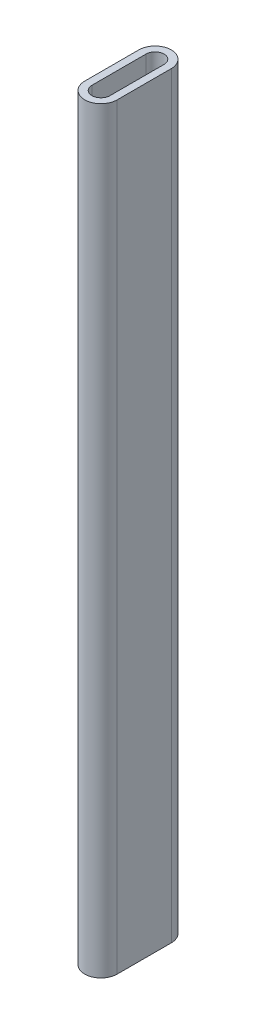
ISO-10303-21;
HEADER;
FILE_DESCRIPTION(('STEP AP214'),'2;1');
FILE_NAME('part.step','',(''),(''),'','','');
FILE_SCHEMA(('AUTOMOTIVE_DESIGN { 1 0 10303 214 1 1 1 1 }'));
ENDSEC;
DATA;
#1=APPLICATION_CONTEXT('core data for automotive mechanical design processes');
#2=APPLICATION_PROTOCOL_DEFINITION('international standard','automotive_design',2000,#1);
#3=PRODUCT_CONTEXT('',#1,'mechanical');
#4=PRODUCT('Part','Part','',(#3));
#5=PRODUCT_RELATED_PRODUCT_CATEGORY('part','',(#4));
#6=PRODUCT_DEFINITION_FORMATION('','',#4);
#7=PRODUCT_DEFINITION_CONTEXT('part definition',#1,'design');
#8=PRODUCT_DEFINITION('design','',#6,#7);
#9=PRODUCT_DEFINITION_SHAPE('','',#8);
#10=(LENGTH_UNIT() NAMED_UNIT(*) SI_UNIT(.MILLI.,.METRE.));
#11=(NAMED_UNIT(*) PLANE_ANGLE_UNIT() SI_UNIT($,.RADIAN.));
#12=(NAMED_UNIT(*) SI_UNIT($,.STERADIAN.) SOLID_ANGLE_UNIT());
#13=UNCERTAINTY_MEASURE_WITH_UNIT(LENGTH_MEASURE(1.E-05),#10,'distance_accuracy_value','');
#14=(GEOMETRIC_REPRESENTATION_CONTEXT(3) GLOBAL_UNCERTAINTY_ASSIGNED_CONTEXT((#13)) GLOBAL_UNIT_ASSIGNED_CONTEXT((#10,
#11,#12)) REPRESENTATION_CONTEXT('',''));
#15=CARTESIAN_POINT('',(0.,0.,0.));
#16=DIRECTION('',(0.,0.,1.));
#17=DIRECTION('',(1.,0.,0.));
#18=AXIS2_PLACEMENT_3D('',#15,#16,#17);
#19=CARTESIAN_POINT('',(-0.0984362378466733,210.,-8.02128028039564));
#20=DIRECTION('',(0.,1.,0.));
#21=DIRECTION('',(0.,0.,1.));
#22=AXIS2_PLACEMENT_3D('',#19,#20,#21);
#23=PLANE('',#22);
#24=CARTESIAN_POINT('',(-0.0984362378466733,210.,-8.02128028039564));
#25=DIRECTION('',(0.,1.,0.));
#26=DIRECTION('',(0.,0.,1.));
#27=AXIS2_PLACEMENT_3D('',#24,#25,#26);
#28=CIRCLE('',#27,4.5);
#29=CARTESIAN_POINT('',(4.40156376215332,210.,-8.02128028039564));
#30=VERTEX_POINT('',#29);
#31=CARTESIAN_POINT('',(-4.59843623784668,210.,-8.02128028039564));
#32=VERTEX_POINT('',#31);
#33=EDGE_CURVE('E138',#30,#32,#28,.T.);
#34=ORIENTED_EDGE('',*,*,#33,.T.);
#35=DIRECTION('',(0.,0.,1.));
#36=VECTOR('',#35,1.);
#37=CARTESIAN_POINT('',(-4.59843623784668,210.,-8.02128028039564));
#38=LINE('',#37,#36);
#39=CARTESIAN_POINT('',(-4.59843623784667,210.,6.97871971960435));
#40=VERTEX_POINT('',#39);
#41=EDGE_CURVE('E141',#32,#40,#38,.T.);
#42=ORIENTED_EDGE('',*,*,#41,.T.);
#43=CARTESIAN_POINT('',(-0.0984362378466663,210.,6.97871971960435));
#44=DIRECTION('',(0.,1.,0.));
#45=DIRECTION('',(0.,0.,1.));
#46=AXIS2_PLACEMENT_3D('',#43,#44,#45);
#47=CIRCLE('',#46,4.5);
#48=CARTESIAN_POINT('',(4.40156376215333,210.,6.97871971960435));
#49=VERTEX_POINT('',#48);
#50=EDGE_CURVE('E144',#40,#49,#47,.T.);
#51=ORIENTED_EDGE('',*,*,#50,.T.);
#52=DIRECTION('',(0.,0.,-1.));
#53=VECTOR('',#52,1.);
#54=CARTESIAN_POINT('',(4.40156376215332,210.,-8.02128028039564));
#55=LINE('',#54,#53);
#56=EDGE_CURVE('E146',#49,#30,#55,.T.);
#57=ORIENTED_EDGE('',*,*,#56,.T.);
#58=EDGE_LOOP('',(#34,#42,#51,#57));
#59=FACE_BOUND('',#58,.T.);
#60=DIRECTION('',(0.,0.,-1.));
#61=VECTOR('',#60,1.);
#62=CARTESIAN_POINT('',(2.40156376215333,210.,-8.02128028039564));
#63=LINE('',#62,#61);
#64=CARTESIAN_POINT('',(2.40156376215333,210.,6.97871971960435));
#65=VERTEX_POINT('',#64);
#66=CARTESIAN_POINT('',(2.40156376215333,210.,-8.02128028039564));
#67=VERTEX_POINT('',#66);
#68=EDGE_CURVE('E110',#65,#67,#63,.T.);
#69=ORIENTED_EDGE('',*,*,#68,.F.);
#70=CARTESIAN_POINT('',(-0.0984362378466663,210.,6.97871971960435));
#71=DIRECTION('',(0.,1.,0.));
#72=DIRECTION('',(0.,0.,1.));
#73=AXIS2_PLACEMENT_3D('',#70,#71,#72);
#74=CIRCLE('',#73,2.5);
#75=CARTESIAN_POINT('',(-2.59843623784666,210.,6.97871971960435));
#76=VERTEX_POINT('',#75);
#77=EDGE_CURVE('E102',#76,#65,#74,.T.);
#78=ORIENTED_EDGE('',*,*,#77,.F.);
#79=DIRECTION('',(0.,0.,1.));
#80=VECTOR('',#79,1.);
#81=CARTESIAN_POINT('',(-2.59843623784668,210.,-8.02128028039564));
#82=LINE('',#81,#80);
#83=CARTESIAN_POINT('',(-2.59843623784668,210.,-8.02128028039564));
#84=VERTEX_POINT('',#83);
#85=EDGE_CURVE('E124',#84,#76,#82,.T.);
#86=ORIENTED_EDGE('',*,*,#85,.F.);
#87=CARTESIAN_POINT('',(-0.0984362378466733,210.,-8.02128028039564));
#88=DIRECTION('',(0.,1.,0.));
#89=DIRECTION('',(0.,0.,1.));
#90=AXIS2_PLACEMENT_3D('',#87,#88,#89);
#91=CIRCLE('',#90,2.5);
#92=EDGE_CURVE('E122',#67,#84,#91,.T.);
#93=ORIENTED_EDGE('',*,*,#92,.F.);
#94=EDGE_LOOP('',(#69,#78,#86,#93));
#95=FACE_BOUND('',#94,.T.);
#96=ADVANCED_FACE('F37',(#59,#95),#23,.T.);
#97=CARTESIAN_POINT('',(-0.0984362378466733,0.,-8.02128028039564));
#98=DIRECTION('',(0.,1.,0.));
#99=DIRECTION('',(0.,0.,1.));
#100=AXIS2_PLACEMENT_3D('',#97,#98,#99);
#101=PLANE('',#100);
#102=CARTESIAN_POINT('',(-0.0984362378466733,0.,-8.02128028039564));
#103=DIRECTION('',(0.,1.,0.));
#104=DIRECTION('',(0.,0.,1.));
#105=AXIS2_PLACEMENT_3D('',#102,#103,#104);
#106=CIRCLE('',#105,4.5);
#107=CARTESIAN_POINT('',(4.40156376215332,0.,-8.02128028039564));
#108=VERTEX_POINT('',#107);
#109=CARTESIAN_POINT('',(-4.59843623784668,0.,-8.02128028039564));
#110=VERTEX_POINT('',#109);
#111=EDGE_CURVE('E118',#108,#110,#106,.T.);
#112=ORIENTED_EDGE('',*,*,#111,.F.);
#113=DIRECTION('',(0.,0.,-1.));
#114=VECTOR('',#113,1.);
#115=CARTESIAN_POINT('',(4.40156376215332,0.,-8.02128028039564));
#116=LINE('',#115,#114);
#117=CARTESIAN_POINT('',(4.40156376215333,0.,6.97871971960435));
#118=VERTEX_POINT('',#117);
#119=EDGE_CURVE('E142',#118,#108,#116,.T.);
#120=ORIENTED_EDGE('',*,*,#119,.F.);
#121=CARTESIAN_POINT('',(-0.0984362378466663,0.,6.97871971960435));
#122=DIRECTION('',(0.,1.,0.));
#123=DIRECTION('',(0.,0.,1.));
#124=AXIS2_PLACEMENT_3D('',#121,#122,#123);
#125=CIRCLE('',#124,4.5);
#126=CARTESIAN_POINT('',(-4.59843623784667,0.,6.97871971960435));
#127=VERTEX_POINT('',#126);
#128=EDGE_CURVE('E153',#127,#118,#125,.T.);
#129=ORIENTED_EDGE('',*,*,#128,.F.);
#130=DIRECTION('',(0.,0.,1.));
#131=VECTOR('',#130,1.);
#132=CARTESIAN_POINT('',(-4.59843623784668,0.,-8.02128028039564));
#133=LINE('',#132,#131);
#134=EDGE_CURVE('E151',#110,#127,#133,.T.);
#135=ORIENTED_EDGE('',*,*,#134,.F.);
#136=EDGE_LOOP('',(#112,#120,#129,#135));
#137=FACE_BOUND('',#136,.T.);
#138=CARTESIAN_POINT('',(-0.0984362378466663,0.,6.97871971960435));
#139=DIRECTION('',(0.,1.,0.));
#140=DIRECTION('',(0.,0.,1.));
#141=AXIS2_PLACEMENT_3D('',#138,#139,#140);
#142=CIRCLE('',#141,2.5);
#143=CARTESIAN_POINT('',(-2.59843623784666,0.,6.97871971960435));
#144=VERTEX_POINT('',#143);
#145=CARTESIAN_POINT('',(2.40156376215333,0.,6.97871971960435));
#146=VERTEX_POINT('',#145);
#147=EDGE_CURVE('E60',#144,#146,#142,.T.);
#148=ORIENTED_EDGE('',*,*,#147,.T.);
#149=DIRECTION('',(0.,0.,-1.));
#150=VECTOR('',#149,1.);
#151=CARTESIAN_POINT('',(2.40156376215333,0.,-8.02128028039564));
#152=LINE('',#151,#150);
#153=CARTESIAN_POINT('',(2.40156376215333,0.,-8.02128028039564));
#154=VERTEX_POINT('',#153);
#155=EDGE_CURVE('E117',#146,#154,#152,.T.);
#156=ORIENTED_EDGE('',*,*,#155,.T.);
#157=CARTESIAN_POINT('',(-0.0984362378466733,0.,-8.02128028039564));
#158=DIRECTION('',(0.,1.,0.));
#159=DIRECTION('',(0.,0.,1.));
#160=AXIS2_PLACEMENT_3D('',#157,#158,#159);
#161=CIRCLE('',#160,2.5);
#162=CARTESIAN_POINT('',(-2.59843623784668,0.,-8.02128028039564));
#163=VERTEX_POINT('',#162);
#164=EDGE_CURVE('E130',#154,#163,#161,.T.);
#165=ORIENTED_EDGE('',*,*,#164,.T.);
#166=DIRECTION('',(0.,0.,1.));
#167=VECTOR('',#166,1.);
#168=CARTESIAN_POINT('',(-2.59843623784668,0.,-8.02128028039564));
#169=LINE('',#168,#167);
#170=EDGE_CURVE('E111',#163,#144,#169,.T.);
#171=ORIENTED_EDGE('',*,*,#170,.T.);
#172=EDGE_LOOP('',(#148,#156,#165,#171));
#173=FACE_BOUND('',#172,.T.);
#174=ADVANCED_FACE('F171',(#137,#173),#101,.F.);
#175=CARTESIAN_POINT('',(-0.0984362378466733,210.,-8.02128028039564));
#176=DIRECTION('',(0.,-1.,0.));
#177=DIRECTION('',(0.,0.,-1.));
#178=AXIS2_PLACEMENT_3D('',#175,#176,#177);
#179=CYLINDRICAL_SURFACE('',#178,4.5);
#180=ORIENTED_EDGE('',*,*,#111,.T.);
#181=DIRECTION('',(0.,-1.,0.));
#182=VECTOR('',#181,1.);
#183=CARTESIAN_POINT('',(-4.59843623784668,210.,-8.02128028039564));
#184=LINE('',#183,#182);
#185=EDGE_CURVE('E11',#32,#110,#184,.T.);
#186=ORIENTED_EDGE('',*,*,#185,.F.);
#187=ORIENTED_EDGE('',*,*,#33,.F.);
#188=DIRECTION('',(0.,-1.,0.));
#189=VECTOR('',#188,1.);
#190=CARTESIAN_POINT('',(4.40156376215332,210.,-8.02128028039564));
#191=LINE('',#190,#189);
#192=EDGE_CURVE('E148',#30,#108,#191,.T.);
#193=ORIENTED_EDGE('',*,*,#192,.T.);
#194=EDGE_LOOP('',(#180,#186,#187,#193));
#195=FACE_BOUND('',#194,.T.);
#196=ADVANCED_FACE('F39',(#195),#179,.T.);
#197=CARTESIAN_POINT('',(-4.59843623784668,210.,-8.02128028039564));
#198=DIRECTION('',(1.,0.,0.));
#199=DIRECTION('',(0.,0.,-1.));
#200=AXIS2_PLACEMENT_3D('',#197,#198,#199);
#201=PLANE('',#200);
#202=ORIENTED_EDGE('',*,*,#134,.T.);
#203=DIRECTION('',(0.,-1.,0.));
#204=VECTOR('',#203,1.);
#205=CARTESIAN_POINT('',(-4.59843623784667,210.,6.97871971960435));
#206=LINE('',#205,#204);
#207=EDGE_CURVE('E45',#40,#127,#206,.T.);
#208=ORIENTED_EDGE('',*,*,#207,.F.);
#209=ORIENTED_EDGE('',*,*,#41,.F.);
#210=ORIENTED_EDGE('',*,*,#185,.T.);
#211=EDGE_LOOP('',(#202,#208,#209,#210));
#212=FACE_BOUND('',#211,.T.);
#213=ADVANCED_FACE('F181',(#212),#201,.F.);
#214=CARTESIAN_POINT('',(-0.0984362378466663,210.,6.97871971960435));
#215=DIRECTION('',(0.,-1.,0.));
#216=DIRECTION('',(0.,0.,-1.));
#217=AXIS2_PLACEMENT_3D('',#214,#215,#216);
#218=CYLINDRICAL_SURFACE('',#217,4.5);
#219=ORIENTED_EDGE('',*,*,#128,.T.);
#220=DIRECTION('',(0.,-1.,0.));
#221=VECTOR('',#220,1.);
#222=CARTESIAN_POINT('',(4.40156376215333,210.,6.97871971960435));
#223=LINE('',#222,#221);
#224=EDGE_CURVE('E158',#49,#118,#223,.T.);
#225=ORIENTED_EDGE('',*,*,#224,.F.);
#226=ORIENTED_EDGE('',*,*,#50,.F.);
#227=ORIENTED_EDGE('',*,*,#207,.T.);
#228=EDGE_LOOP('',(#219,#225,#226,#227));
#229=FACE_BOUND('',#228,.T.);
#230=ADVANCED_FACE('F165',(#229),#218,.T.);
#231=CARTESIAN_POINT('',(4.40156376215332,210.,-8.02128028039564));
#232=DIRECTION('',(-1.,0.,0.));
#233=DIRECTION('',(0.,0.,1.));
#234=AXIS2_PLACEMENT_3D('',#231,#232,#233);
#235=PLANE('',#234);
#236=ORIENTED_EDGE('',*,*,#119,.T.);
#237=ORIENTED_EDGE('',*,*,#192,.F.);
#238=ORIENTED_EDGE('',*,*,#56,.F.);
#239=ORIENTED_EDGE('',*,*,#224,.T.);
#240=EDGE_LOOP('',(#236,#237,#238,#239));
#241=FACE_BOUND('',#240,.T.);
#242=ADVANCED_FACE('F175',(#241),#235,.F.);
#243=CARTESIAN_POINT('',(-0.0984362378466663,210.,6.97871971960435));
#244=DIRECTION('',(0.,-1.,0.));
#245=DIRECTION('',(0.,0.,-1.));
#246=AXIS2_PLACEMENT_3D('',#243,#244,#245);
#247=CYLINDRICAL_SURFACE('',#246,2.5);
#248=ORIENTED_EDGE('',*,*,#147,.F.);
#249=DIRECTION('',(0.,-1.,0.));
#250=VECTOR('',#249,1.);
#251=CARTESIAN_POINT('',(-2.59843623784666,210.,6.97871971960435));
#252=LINE('',#251,#250);
#253=EDGE_CURVE('E106',#76,#144,#252,.T.);
#254=ORIENTED_EDGE('',*,*,#253,.F.);
#255=ORIENTED_EDGE('',*,*,#77,.T.);
#256=DIRECTION('',(0.,-1.,0.));
#257=VECTOR('',#256,1.);
#258=CARTESIAN_POINT('',(2.40156376215333,210.,6.97871971960435));
#259=LINE('',#258,#257);
#260=EDGE_CURVE('E105',#65,#146,#259,.T.);
#261=ORIENTED_EDGE('',*,*,#260,.T.);
#262=EDGE_LOOP('',(#248,#254,#255,#261));
#263=FACE_BOUND('',#262,.T.);
#264=ADVANCED_FACE('F104',(#263),#247,.F.);
#265=CARTESIAN_POINT('',(2.40156376215333,210.,-8.02128028039564));
#266=DIRECTION('',(-1.,0.,0.));
#267=DIRECTION('',(0.,0.,1.));
#268=AXIS2_PLACEMENT_3D('',#265,#266,#267);
#269=PLANE('',#268);
#270=ORIENTED_EDGE('',*,*,#155,.F.);
#271=ORIENTED_EDGE('',*,*,#260,.F.);
#272=ORIENTED_EDGE('',*,*,#68,.T.);
#273=DIRECTION('',(0.,-1.,0.));
#274=VECTOR('',#273,1.);
#275=CARTESIAN_POINT('',(2.40156376215333,210.,-8.02128028039564));
#276=LINE('',#275,#274);
#277=EDGE_CURVE('E119',#67,#154,#276,.T.);
#278=ORIENTED_EDGE('',*,*,#277,.T.);
#279=EDGE_LOOP('',(#270,#271,#272,#278));
#280=FACE_BOUND('',#279,.T.);
#281=ADVANCED_FACE('F114',(#280),#269,.T.);
#282=CARTESIAN_POINT('',(-0.0984362378466733,210.,-8.02128028039564));
#283=DIRECTION('',(0.,-1.,0.));
#284=DIRECTION('',(0.,0.,-1.));
#285=AXIS2_PLACEMENT_3D('',#282,#283,#284);
#286=CYLINDRICAL_SURFACE('',#285,2.5);
#287=ORIENTED_EDGE('',*,*,#164,.F.);
#288=ORIENTED_EDGE('',*,*,#277,.F.);
#289=ORIENTED_EDGE('',*,*,#92,.T.);
#290=DIRECTION('',(0.,-1.,0.));
#291=VECTOR('',#290,1.);
#292=CARTESIAN_POINT('',(-2.59843623784668,210.,-8.02128028039564));
#293=LINE('',#292,#291);
#294=EDGE_CURVE('E52',#84,#163,#293,.T.);
#295=ORIENTED_EDGE('',*,*,#294,.T.);
#296=EDGE_LOOP('',(#287,#288,#289,#295));
#297=FACE_BOUND('',#296,.T.);
#298=ADVANCED_FACE('F204',(#297),#286,.F.);
#299=CARTESIAN_POINT('',(-2.59843623784668,210.,-8.02128028039564));
#300=DIRECTION('',(1.,0.,0.));
#301=DIRECTION('',(0.,0.,-1.));
#302=AXIS2_PLACEMENT_3D('',#299,#300,#301);
#303=PLANE('',#302);
#304=ORIENTED_EDGE('',*,*,#170,.F.);
#305=ORIENTED_EDGE('',*,*,#294,.F.);
#306=ORIENTED_EDGE('',*,*,#85,.T.);
#307=ORIENTED_EDGE('',*,*,#253,.T.);
#308=EDGE_LOOP('',(#304,#305,#306,#307));
#309=FACE_BOUND('',#308,.T.);
#310=ADVANCED_FACE('F208',(#309),#303,.T.);
#311=CLOSED_SHELL('',(#96,#174,#196,#213,#230,#242,#264,#281,#298,#310));
#312=MANIFOLD_SOLID_BREP('B2',#311);
#313=ADVANCED_BREP_SHAPE_REPRESENTATION('',(#18,#312),#14);
#314=SHAPE_DEFINITION_REPRESENTATION(#9,#313);
ENDSEC;
END-ISO-10303-21;
